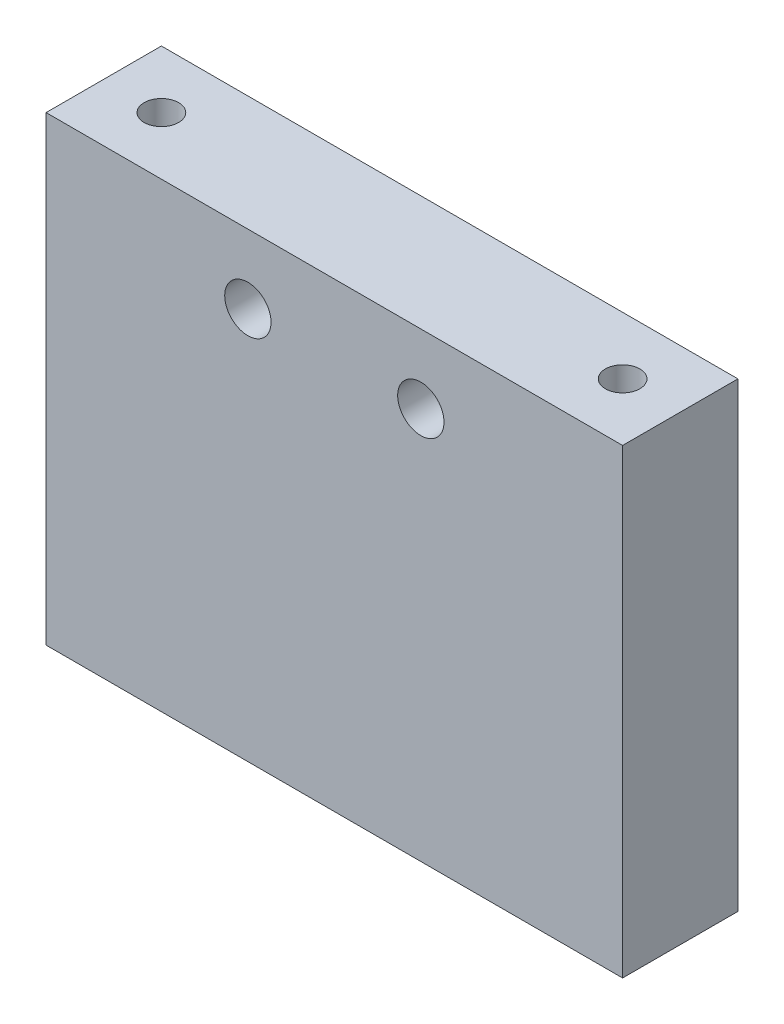
ISO-10303-21;
HEADER;
FILE_DESCRIPTION(('STEP AP214'),'2;1');
FILE_NAME('part.step','',(''),(''),'','','');
FILE_SCHEMA(('AUTOMOTIVE_DESIGN { 1 0 10303 214 1 1 1 1 }'));
ENDSEC;
DATA;
#1=APPLICATION_CONTEXT('core data for automotive mechanical design processes');
#2=APPLICATION_PROTOCOL_DEFINITION('international standard','automotive_design',2000,#1);
#3=PRODUCT_CONTEXT('',#1,'mechanical');
#4=PRODUCT('Part','Part','',(#3));
#5=PRODUCT_RELATED_PRODUCT_CATEGORY('part','',(#4));
#6=PRODUCT_DEFINITION_FORMATION('','',#4);
#7=PRODUCT_DEFINITION_CONTEXT('part definition',#1,'design');
#8=PRODUCT_DEFINITION('design','',#6,#7);
#9=PRODUCT_DEFINITION_SHAPE('','',#8);
#10=(LENGTH_UNIT() NAMED_UNIT(*) SI_UNIT(.MILLI.,.METRE.));
#11=(NAMED_UNIT(*) PLANE_ANGLE_UNIT() SI_UNIT($,.RADIAN.));
#12=(NAMED_UNIT(*) SI_UNIT($,.STERADIAN.) SOLID_ANGLE_UNIT());
#13=UNCERTAINTY_MEASURE_WITH_UNIT(LENGTH_MEASURE(1.E-05),#10,'distance_accuracy_value','');
#14=(GEOMETRIC_REPRESENTATION_CONTEXT(3) GLOBAL_UNCERTAINTY_ASSIGNED_CONTEXT((#13)) GLOBAL_UNIT_ASSIGNED_CONTEXT((#10,
#11,#12)) REPRESENTATION_CONTEXT('',''));
#15=CARTESIAN_POINT('',(0.,0.,0.));
#16=DIRECTION('',(0.,0.,1.));
#17=DIRECTION('',(1.,0.,0.));
#18=AXIS2_PLACEMENT_3D('',#15,#16,#17);
#19=CARTESIAN_POINT('',(0.,50.8,0.));
#20=DIRECTION('',(-1.,0.,0.));
#21=DIRECTION('',(0.,0.,1.));
#22=AXIS2_PLACEMENT_3D('',#19,#20,#21);
#23=PLANE('',#22);
#24=DIRECTION('',(0.,0.,-1.));
#25=VECTOR('',#24,1.);
#26=CARTESIAN_POINT('',(0.,0.,0.));
#27=LINE('',#26,#25);
#28=CARTESIAN_POINT('',(0.,0.,0.));
#29=VERTEX_POINT('',#28);
#30=CARTESIAN_POINT('',(0.,0.,-12.7));
#31=VERTEX_POINT('',#30);
#32=EDGE_CURVE('E106',#29,#31,#27,.T.);
#33=ORIENTED_EDGE('',*,*,#32,.F.);
#34=DIRECTION('',(0.,-1.,0.));
#35=VECTOR('',#34,1.);
#36=CARTESIAN_POINT('',(0.,50.8,0.));
#37=LINE('',#36,#35);
#38=CARTESIAN_POINT('',(0.,50.8,0.));
#39=VERTEX_POINT('',#38);
#40=EDGE_CURVE('E11',#39,#29,#37,.T.);
#41=ORIENTED_EDGE('',*,*,#40,.F.);
#42=DIRECTION('',(0.,0.,-1.));
#43=VECTOR('',#42,1.);
#44=CARTESIAN_POINT('',(0.,50.8,0.));
#45=LINE('',#44,#43);
#46=CARTESIAN_POINT('',(0.,50.8,-12.7));
#47=VERTEX_POINT('',#46);
#48=EDGE_CURVE('E107',#39,#47,#45,.T.);
#49=ORIENTED_EDGE('',*,*,#48,.T.);
#50=DIRECTION('',(0.,-1.,0.));
#51=VECTOR('',#50,1.);
#52=CARTESIAN_POINT('',(0.,50.8,-12.7));
#53=LINE('',#52,#51);
#54=EDGE_CURVE('E36',#47,#31,#53,.T.);
#55=ORIENTED_EDGE('',*,*,#54,.T.);
#56=EDGE_LOOP('',(#33,#41,#49,#55));
#57=FACE_BOUND('',#56,.T.);
#58=ADVANCED_FACE('F33',(#57),#23,.T.);
#59=CARTESIAN_POINT('',(0.,50.8,0.));
#60=DIRECTION('',(0.,0.,-1.));
#61=DIRECTION('',(-1.,0.,0.));
#62=AXIS2_PLACEMENT_3D('',#59,#60,#61);
#63=PLANE('',#62);
#64=CARTESIAN_POINT('',(22.225,43.18,0.));
#65=DIRECTION('',(0.,0.,-1.));
#66=DIRECTION('',(-1.,0.,0.));
#67=AXIS2_PLACEMENT_3D('',#64,#65,#66);
#68=CIRCLE('',#67,2.5527);
#69=CARTESIAN_POINT('',(19.6723,43.18,0.));
#70=VERTEX_POINT('',#69);
#71=EDGE_CURVE('E163',#70,#70,#68,.T.);
#72=ORIENTED_EDGE('',*,*,#71,.T.);
#73=EDGE_LOOP('',(#72));
#74=FACE_BOUND('',#73,.T.);
#75=CARTESIAN_POINT('',(41.275,43.18,0.));
#76=DIRECTION('',(0.,0.,-1.));
#77=DIRECTION('',(-1.,0.,0.));
#78=AXIS2_PLACEMENT_3D('',#75,#76,#77);
#79=CIRCLE('',#78,2.5527);
#80=CARTESIAN_POINT('',(38.7223,43.18,0.));
#81=VERTEX_POINT('',#80);
#82=EDGE_CURVE('E100',#81,#81,#79,.T.);
#83=ORIENTED_EDGE('',*,*,#82,.T.);
#84=EDGE_LOOP('',(#83));
#85=FACE_BOUND('',#84,.T.);
#86=DIRECTION('',(1.,0.,0.));
#87=VECTOR('',#86,1.);
#88=CARTESIAN_POINT('',(0.,0.,0.));
#89=LINE('',#88,#87);
#90=CARTESIAN_POINT('',(63.5,0.,0.));
#91=VERTEX_POINT('',#90);
#92=EDGE_CURVE('E67',#29,#91,#89,.T.);
#93=ORIENTED_EDGE('',*,*,#92,.T.);
#94=DIRECTION('',(0.,-1.,0.));
#95=VECTOR('',#94,1.);
#96=CARTESIAN_POINT('',(63.5,50.8,0.));
#97=LINE('',#96,#95);
#98=CARTESIAN_POINT('',(63.5,50.8,0.));
#99=VERTEX_POINT('',#98);
#100=EDGE_CURVE('E42',#99,#91,#97,.T.);
#101=ORIENTED_EDGE('',*,*,#100,.F.);
#102=DIRECTION('',(1.,0.,0.));
#103=VECTOR('',#102,1.);
#104=CARTESIAN_POINT('',(0.,50.8,0.));
#105=LINE('',#104,#103);
#106=EDGE_CURVE('E113',#39,#99,#105,.T.);
#107=ORIENTED_EDGE('',*,*,#106,.F.);
#108=ORIENTED_EDGE('',*,*,#40,.T.);
#109=EDGE_LOOP('',(#93,#101,#107,#108));
#110=FACE_BOUND('',#109,.T.);
#111=ADVANCED_FACE('F134',(#74,#85,#110),#63,.F.);
#112=CARTESIAN_POINT('',(63.5,50.8,0.));
#113=DIRECTION('',(-1.,0.,0.));
#114=DIRECTION('',(0.,0.,1.));
#115=AXIS2_PLACEMENT_3D('',#112,#113,#114);
#116=PLANE('',#115);
#117=DIRECTION('',(0.,0.,-1.));
#118=VECTOR('',#117,1.);
#119=CARTESIAN_POINT('',(63.5,0.,0.));
#120=LINE('',#119,#118);
#121=CARTESIAN_POINT('',(63.5,0.,-12.7));
#122=VERTEX_POINT('',#121);
#123=EDGE_CURVE('E120',#91,#122,#120,.T.);
#124=ORIENTED_EDGE('',*,*,#123,.T.);
#125=DIRECTION('',(0.,-1.,0.));
#126=VECTOR('',#125,1.);
#127=CARTESIAN_POINT('',(63.5,50.8,-12.7));
#128=LINE('',#127,#126);
#129=CARTESIAN_POINT('',(63.5,50.8,-12.7));
#130=VERTEX_POINT('',#129);
#131=EDGE_CURVE('E124',#130,#122,#128,.T.);
#132=ORIENTED_EDGE('',*,*,#131,.F.);
#133=DIRECTION('',(0.,0.,-1.));
#134=VECTOR('',#133,1.);
#135=CARTESIAN_POINT('',(63.5,50.8,0.));
#136=LINE('',#135,#134);
#137=EDGE_CURVE('E111',#99,#130,#136,.T.);
#138=ORIENTED_EDGE('',*,*,#137,.F.);
#139=ORIENTED_EDGE('',*,*,#100,.T.);
#140=EDGE_LOOP('',(#124,#132,#138,#139));
#141=FACE_BOUND('',#140,.T.);
#142=ADVANCED_FACE('F132',(#141),#116,.F.);
#143=CARTESIAN_POINT('',(0.,50.8,-12.7));
#144=DIRECTION('',(0.,0.,-1.));
#145=DIRECTION('',(-1.,0.,0.));
#146=AXIS2_PLACEMENT_3D('',#143,#144,#145);
#147=PLANE('',#146);
#148=CARTESIAN_POINT('',(22.225,43.18,-12.7));
#149=DIRECTION('',(0.,0.,-1.));
#150=DIRECTION('',(-1.,0.,0.));
#151=AXIS2_PLACEMENT_3D('',#148,#149,#150);
#152=CIRCLE('',#151,2.5527);
#153=CARTESIAN_POINT('',(19.6723,43.18,-12.7));
#154=VERTEX_POINT('',#153);
#155=EDGE_CURVE('E172',#154,#154,#152,.T.);
#156=ORIENTED_EDGE('',*,*,#155,.F.);
#157=EDGE_LOOP('',(#156));
#158=FACE_BOUND('',#157,.T.);
#159=CARTESIAN_POINT('',(41.275,43.18,-12.7));
#160=DIRECTION('',(0.,0.,-1.));
#161=DIRECTION('',(-1.,0.,0.));
#162=AXIS2_PLACEMENT_3D('',#159,#160,#161);
#163=CIRCLE('',#162,2.5527);
#164=CARTESIAN_POINT('',(38.7223,43.18,-12.7));
#165=VERTEX_POINT('',#164);
#166=EDGE_CURVE('E167',#165,#165,#163,.T.);
#167=ORIENTED_EDGE('',*,*,#166,.F.);
#168=EDGE_LOOP('',(#167));
#169=FACE_BOUND('',#168,.T.);
#170=DIRECTION('',(1.,0.,0.));
#171=VECTOR('',#170,1.);
#172=CARTESIAN_POINT('',(0.,0.,-12.7));
#173=LINE('',#172,#171);
#174=EDGE_CURVE('E117',#31,#122,#173,.T.);
#175=ORIENTED_EDGE('',*,*,#174,.F.);
#176=ORIENTED_EDGE('',*,*,#54,.F.);
#177=DIRECTION('',(1.,0.,0.));
#178=VECTOR('',#177,1.);
#179=CARTESIAN_POINT('',(0.,50.8,-12.7));
#180=LINE('',#179,#178);
#181=EDGE_CURVE('E109',#47,#130,#180,.T.);
#182=ORIENTED_EDGE('',*,*,#181,.T.);
#183=ORIENTED_EDGE('',*,*,#131,.T.);
#184=EDGE_LOOP('',(#175,#176,#182,#183));
#185=FACE_BOUND('',#184,.T.);
#186=ADVANCED_FACE('F127',(#158,#169,#185),#147,.T.);
#187=CARTESIAN_POINT('',(0.,50.8,0.));
#188=DIRECTION('',(0.,-1.,0.));
#189=DIRECTION('',(0.,0.,-1.));
#190=AXIS2_PLACEMENT_3D('',#187,#188,#189);
#191=PLANE('',#190);
#192=CARTESIAN_POINT('',(6.35,50.8,-6.35));
#193=DIRECTION('',(0.,1.,0.));
#194=DIRECTION('',(0.,0.,1.));
#195=AXIS2_PLACEMENT_3D('',#192,#193,#194);
#196=CIRCLE('',#195,1.89864999999999);
#197=CARTESIAN_POINT('',(6.35,50.8,-4.45135000000001));
#198=VERTEX_POINT('',#197);
#199=EDGE_CURVE('E94',#198,#198,#196,.T.);
#200=ORIENTED_EDGE('',*,*,#199,.F.);
#201=EDGE_LOOP('',(#200));
#202=FACE_BOUND('',#201,.T.);
#203=CARTESIAN_POINT('',(57.15,50.8,-6.35000000000001));
#204=DIRECTION('',(0.,1.,0.));
#205=DIRECTION('',(0.,0.,1.));
#206=AXIS2_PLACEMENT_3D('',#203,#204,#205);
#207=CIRCLE('',#206,1.89864999999999);
#208=CARTESIAN_POINT('',(57.15,50.8,-4.45135000000002));
#209=VERTEX_POINT('',#208);
#210=EDGE_CURVE('E93',#209,#209,#207,.T.);
#211=ORIENTED_EDGE('',*,*,#210,.F.);
#212=EDGE_LOOP('',(#211));
#213=FACE_BOUND('',#212,.T.);
#214=ORIENTED_EDGE('',*,*,#48,.F.);
#215=ORIENTED_EDGE('',*,*,#106,.T.);
#216=ORIENTED_EDGE('',*,*,#137,.T.);
#217=ORIENTED_EDGE('',*,*,#181,.F.);
#218=EDGE_LOOP('',(#214,#215,#216,#217));
#219=FACE_BOUND('',#218,.T.);
#220=ADVANCED_FACE('F136',(#202,#213,#219),#191,.F.);
#221=CARTESIAN_POINT('',(0.,0.,0.));
#222=DIRECTION('',(0.,-1.,0.));
#223=DIRECTION('',(0.,0.,-1.));
#224=AXIS2_PLACEMENT_3D('',#221,#222,#223);
#225=PLANE('',#224);
#226=ORIENTED_EDGE('',*,*,#32,.T.);
#227=ORIENTED_EDGE('',*,*,#174,.T.);
#228=ORIENTED_EDGE('',*,*,#123,.F.);
#229=ORIENTED_EDGE('',*,*,#92,.F.);
#230=EDGE_LOOP('',(#226,#227,#228,#229));
#231=FACE_BOUND('',#230,.T.);
#232=ADVANCED_FACE('F130',(#231),#225,.T.);
#233=CARTESIAN_POINT('',(57.15,38.1,-6.35000000000001));
#234=DIRECTION('',(0.,1.,0.));
#235=DIRECTION('',(0.,0.,1.));
#236=AXIS2_PLACEMENT_3D('',#233,#234,#235);
#237=CONICAL_SURFACE('',#236,1.89864999999999,1.02974425867666);
#238=CARTESIAN_POINT('',(57.15,36.9591759856833,-6.35000000000001));
#239=VERTEX_POINT('',#238);
#240=VERTEX_LOOP('',#239);
#241=FACE_BOUND('',#240,.T.);
#242=CARTESIAN_POINT('',(57.15,38.1,-6.35000000000001));
#243=DIRECTION('',(0.,1.,0.));
#244=DIRECTION('',(0.,0.,1.));
#245=AXIS2_PLACEMENT_3D('',#242,#243,#244);
#246=CIRCLE('',#245,1.89864999999999);
#247=CARTESIAN_POINT('',(57.15,38.1,-4.45135000000001));
#248=VERTEX_POINT('',#247);
#249=EDGE_CURVE('E97',#248,#248,#246,.T.);
#250=ORIENTED_EDGE('',*,*,#249,.T.);
#251=EDGE_LOOP('',(#250));
#252=FACE_BOUND('',#251,.T.);
#253=ADVANCED_FACE('F144',(#241,#252),#237,.F.);
#254=CARTESIAN_POINT('',(57.15,50.8,-6.35000000000001));
#255=DIRECTION('',(0.,1.,0.));
#256=DIRECTION('',(0.,0.,1.));
#257=AXIS2_PLACEMENT_3D('',#254,#255,#256);
#258=CYLINDRICAL_SURFACE('',#257,1.89864999999999);
#259=ORIENTED_EDGE('',*,*,#249,.F.);
#260=EDGE_LOOP('',(#259));
#261=FACE_BOUND('',#260,.T.);
#262=ORIENTED_EDGE('',*,*,#210,.T.);
#263=EDGE_LOOP('',(#262));
#264=FACE_BOUND('',#263,.T.);
#265=ADVANCED_FACE('F87',(#261,#264),#258,.F.);
#266=CARTESIAN_POINT('',(6.35,38.1,-6.35));
#267=DIRECTION('',(0.,1.,0.));
#268=DIRECTION('',(0.,0.,1.));
#269=AXIS2_PLACEMENT_3D('',#266,#267,#268);
#270=CONICAL_SURFACE('',#269,1.89864999999999,1.02974425867665);
#271=CARTESIAN_POINT('',(6.35,36.9591759856833,-6.35));
#272=VERTEX_POINT('',#271);
#273=VERTEX_LOOP('',#272);
#274=FACE_BOUND('',#273,.T.);
#275=CARTESIAN_POINT('',(6.35,38.1,-6.35));
#276=DIRECTION('',(0.,1.,0.));
#277=DIRECTION('',(0.,0.,1.));
#278=AXIS2_PLACEMENT_3D('',#275,#276,#277);
#279=CIRCLE('',#278,1.89864999999999);
#280=CARTESIAN_POINT('',(6.35,38.1,-4.45135000000001));
#281=VERTEX_POINT('',#280);
#282=EDGE_CURVE('E91',#281,#281,#279,.T.);
#283=ORIENTED_EDGE('',*,*,#282,.T.);
#284=EDGE_LOOP('',(#283));
#285=FACE_BOUND('',#284,.T.);
#286=ADVANCED_FACE('F83',(#274,#285),#270,.F.);
#287=CARTESIAN_POINT('',(6.35,50.8,-6.35));
#288=DIRECTION('',(0.,1.,0.));
#289=DIRECTION('',(0.,0.,1.));
#290=AXIS2_PLACEMENT_3D('',#287,#288,#289);
#291=CYLINDRICAL_SURFACE('',#290,1.89864999999999);
#292=ORIENTED_EDGE('',*,*,#282,.F.);
#293=EDGE_LOOP('',(#292));
#294=FACE_BOUND('',#293,.T.);
#295=ORIENTED_EDGE('',*,*,#199,.T.);
#296=EDGE_LOOP('',(#295));
#297=FACE_BOUND('',#296,.T.);
#298=ADVANCED_FACE('F86',(#294,#297),#291,.F.);
#299=CARTESIAN_POINT('',(41.275,43.18,-12.7));
#300=DIRECTION('',(0.,0.,-1.));
#301=DIRECTION('',(-1.,0.,0.));
#302=AXIS2_PLACEMENT_3D('',#299,#300,#301);
#303=CYLINDRICAL_SURFACE('',#302,2.5527);
#304=ORIENTED_EDGE('',*,*,#82,.F.);
#305=EDGE_LOOP('',(#304));
#306=FACE_BOUND('',#305,.T.);
#307=ORIENTED_EDGE('',*,*,#166,.T.);
#308=EDGE_LOOP('',(#307));
#309=FACE_BOUND('',#308,.T.);
#310=ADVANCED_FACE('F180',(#306,#309),#303,.F.);
#311=CARTESIAN_POINT('',(22.225,43.18,-12.7));
#312=DIRECTION('',(0.,0.,-1.));
#313=DIRECTION('',(-1.,0.,0.));
#314=AXIS2_PLACEMENT_3D('',#311,#312,#313);
#315=CYLINDRICAL_SURFACE('',#314,2.5527);
#316=ORIENTED_EDGE('',*,*,#71,.F.);
#317=EDGE_LOOP('',(#316));
#318=FACE_BOUND('',#317,.T.);
#319=ORIENTED_EDGE('',*,*,#155,.T.);
#320=EDGE_LOOP('',(#319));
#321=FACE_BOUND('',#320,.T.);
#322=ADVANCED_FACE('F176',(#318,#321),#315,.F.);
#323=CLOSED_SHELL('',(#58,#111,#142,#186,#220,#232,#253,#265,#286,#298,#310,#322));
#324=MANIFOLD_SOLID_BREP('B2',#323);
#325=ADVANCED_BREP_SHAPE_REPRESENTATION('',(#18,#324),#14);
#326=SHAPE_DEFINITION_REPRESENTATION(#9,#325);
ENDSEC;
END-ISO-10303-21;
